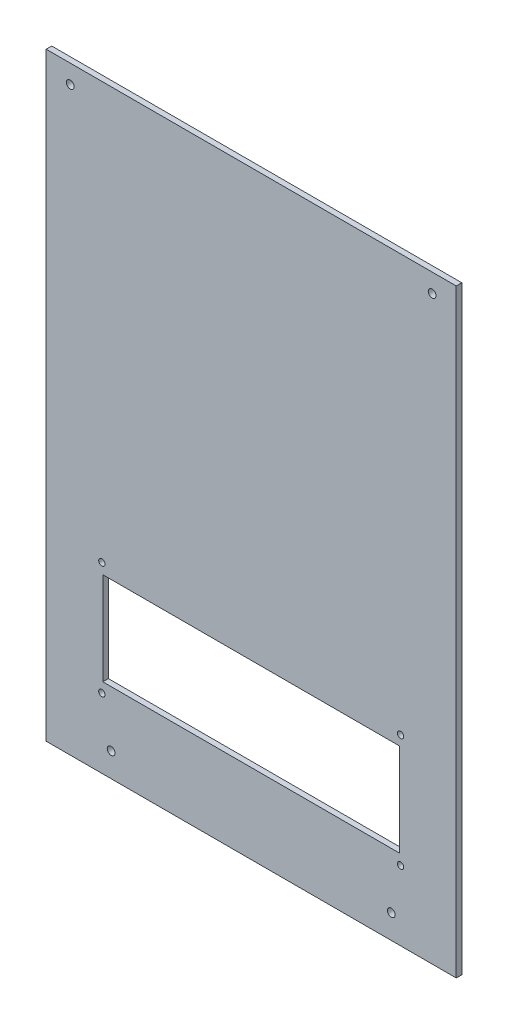
ISO-10303-21;
HEADER;
FILE_DESCRIPTION(('STEP AP214'),'2;1');
FILE_NAME('part.step','',(''),(''),'','','');
FILE_SCHEMA(('AUTOMOTIVE_DESIGN { 1 0 10303 214 1 1 1 1 }'));
ENDSEC;
DATA;
#1=APPLICATION_CONTEXT('core data for automotive mechanical design processes');
#2=APPLICATION_PROTOCOL_DEFINITION('international standard','automotive_design',2000,#1);
#3=PRODUCT_CONTEXT('',#1,'mechanical');
#4=PRODUCT('Part','Part','',(#3));
#5=PRODUCT_RELATED_PRODUCT_CATEGORY('part','',(#4));
#6=PRODUCT_DEFINITION_FORMATION('','',#4);
#7=PRODUCT_DEFINITION_CONTEXT('part definition',#1,'design');
#8=PRODUCT_DEFINITION('design','',#6,#7);
#9=PRODUCT_DEFINITION_SHAPE('','',#8);
#10=(LENGTH_UNIT() NAMED_UNIT(*) SI_UNIT(.MILLI.,.METRE.));
#11=(NAMED_UNIT(*) PLANE_ANGLE_UNIT() SI_UNIT($,.RADIAN.));
#12=(NAMED_UNIT(*) SI_UNIT($,.STERADIAN.) SOLID_ANGLE_UNIT());
#13=UNCERTAINTY_MEASURE_WITH_UNIT(LENGTH_MEASURE(1.E-05),#10,'distance_accuracy_value','');
#14=(GEOMETRIC_REPRESENTATION_CONTEXT(3) GLOBAL_UNCERTAINTY_ASSIGNED_CONTEXT((#13)) GLOBAL_UNIT_ASSIGNED_CONTEXT((#10,
#11,#12)) REPRESENTATION_CONTEXT('',''));
#15=CARTESIAN_POINT('',(0.,0.,0.));
#16=DIRECTION('',(0.,0.,1.));
#17=DIRECTION('',(1.,0.,0.));
#18=AXIS2_PLACEMENT_3D('',#15,#16,#17);
#19=CARTESIAN_POINT('',(0.,0.,-122.5));
#20=DIRECTION('',(0.,0.,-1.));
#21=DIRECTION('',(-1.,0.,0.));
#22=AXIS2_PLACEMENT_3D('',#19,#20,#21);
#23=PLANE('',#22);
#24=CARTESIAN_POINT('',(-75.5,0.,-122.5));
#25=DIRECTION('',(0.,0.,1.));
#26=DIRECTION('',(1.,0.,0.));
#27=AXIS2_PLACEMENT_3D('',#24,#25,#26);
#28=CIRCLE('',#27,2.1);
#29=CARTESIAN_POINT('',(-73.4,0.,-122.5));
#30=VERTEX_POINT('',#29);
#31=EDGE_CURVE('E278',#30,#30,#28,.T.);
#32=ORIENTED_EDGE('',*,*,#31,.F.);
#33=EDGE_LOOP('',(#32));
#34=FACE_BOUND('',#33,.T.);
#35=CARTESIAN_POINT('',(80.5,85.5,-122.5));
#36=DIRECTION('',(0.,0.,-1.));
#37=DIRECTION('',(-1.,0.,0.));
#38=AXIS2_PLACEMENT_3D('',#35,#36,#37);
#39=CIRCLE('',#38,1.70000000000001);
#40=CARTESIAN_POINT('',(78.8,85.5,-122.5));
#41=VERTEX_POINT('',#40);
#42=EDGE_CURVE('E265',#41,#41,#39,.F.);
#43=ORIENTED_EDGE('',*,*,#42,.F.);
#44=EDGE_LOOP('',(#43));
#45=FACE_BOUND('',#44,.T.);
#46=CARTESIAN_POINT('',(80.5,24.5,-122.5));
#47=DIRECTION('',(0.,0.,-1.));
#48=DIRECTION('',(-1.,0.,0.));
#49=AXIS2_PLACEMENT_3D('',#46,#47,#48);
#50=CIRCLE('',#49,1.70000000000001);
#51=CARTESIAN_POINT('',(78.8,24.5,-122.5));
#52=VERTEX_POINT('',#51);
#53=EDGE_CURVE('E271',#52,#52,#50,.F.);
#54=ORIENTED_EDGE('',*,*,#53,.F.);
#55=EDGE_LOOP('',(#54));
#56=FACE_BOUND('',#55,.T.);
#57=CARTESIAN_POINT('',(-80.5,24.5,-122.5));
#58=DIRECTION('',(0.,0.,-1.));
#59=DIRECTION('',(-1.,0.,0.));
#60=AXIS2_PLACEMENT_3D('',#57,#58,#59);
#61=CIRCLE('',#60,1.70000000000001);
#62=CARTESIAN_POINT('',(-82.2,24.5,-122.5));
#63=VERTEX_POINT('',#62);
#64=EDGE_CURVE('E259',#63,#63,#61,.F.);
#65=ORIENTED_EDGE('',*,*,#64,.F.);
#66=EDGE_LOOP('',(#65));
#67=FACE_BOUND('',#66,.T.);
#68=CARTESIAN_POINT('',(-80.5,85.5,-122.5));
#69=DIRECTION('',(0.,0.,-1.));
#70=DIRECTION('',(-1.,0.,0.));
#71=AXIS2_PLACEMENT_3D('',#68,#69,#70);
#72=CIRCLE('',#71,1.7);
#73=CARTESIAN_POINT('',(-82.2,85.5,-122.5));
#74=VERTEX_POINT('',#73);
#75=EDGE_CURVE('E139',#74,#74,#72,.F.);
#76=ORIENTED_EDGE('',*,*,#75,.F.);
#77=EDGE_LOOP('',(#76));
#78=FACE_BOUND('',#77,.T.);
#79=DIRECTION('',(1.,0.,0.));
#80=VECTOR('',#79,1.);
#81=CARTESIAN_POINT('',(-80.,30.,-122.5));
#82=LINE('',#81,#80);
#83=CARTESIAN_POINT('',(-80.,30.,-122.5));
#84=VERTEX_POINT('',#83);
#85=CARTESIAN_POINT('',(80.,30.,-122.5));
#86=VERTEX_POINT('',#85);
#87=EDGE_CURVE('E147',#84,#86,#82,.T.);
#88=ORIENTED_EDGE('',*,*,#87,.F.);
#89=DIRECTION('',(0.,-1.,0.));
#90=VECTOR('',#89,1.);
#91=CARTESIAN_POINT('',(-80.,80.,-122.5));
#92=LINE('',#91,#90);
#93=CARTESIAN_POINT('',(-80.,80.,-122.5));
#94=VERTEX_POINT('',#93);
#95=EDGE_CURVE('E59',#94,#84,#92,.T.);
#96=ORIENTED_EDGE('',*,*,#95,.F.);
#97=DIRECTION('',(-1.,0.,0.));
#98=VECTOR('',#97,1.);
#99=CARTESIAN_POINT('',(-80.,80.,-122.5));
#100=LINE('',#99,#98);
#101=CARTESIAN_POINT('',(80.,80.,-122.5));
#102=VERTEX_POINT('',#101);
#103=EDGE_CURVE('E131',#102,#94,#100,.T.);
#104=ORIENTED_EDGE('',*,*,#103,.F.);
#105=DIRECTION('',(0.,1.,0.));
#106=VECTOR('',#105,1.);
#107=CARTESIAN_POINT('',(80.,80.,-122.5));
#108=LINE('',#107,#106);
#109=EDGE_CURVE('E136',#86,#102,#108,.T.);
#110=ORIENTED_EDGE('',*,*,#109,.F.);
#111=EDGE_LOOP('',(#88,#96,#104,#110));
#112=FACE_BOUND('',#111,.T.);
#113=DIRECTION('',(0.,-1.,0.));
#114=VECTOR('',#113,1.);
#115=CARTESIAN_POINT('',(110.5,310.,-122.5));
#116=LINE('',#115,#114);
#117=CARTESIAN_POINT('',(110.5,310.,-122.5));
#118=VERTEX_POINT('',#117);
#119=CARTESIAN_POINT('',(110.5,-13.,-122.5));
#120=VERTEX_POINT('',#119);
#121=EDGE_CURVE('E160',#118,#120,#116,.T.);
#122=ORIENTED_EDGE('',*,*,#121,.F.);
#123=DIRECTION('',(1.,0.,0.));
#124=VECTOR('',#123,1.);
#125=CARTESIAN_POINT('',(110.5,310.,-122.5));
#126=LINE('',#125,#124);
#127=CARTESIAN_POINT('',(-110.5,310.,-122.5));
#128=VERTEX_POINT('',#127);
#129=EDGE_CURVE('E171',#128,#118,#126,.T.);
#130=ORIENTED_EDGE('',*,*,#129,.F.);
#131=DIRECTION('',(0.,1.,0.));
#132=VECTOR('',#131,1.);
#133=CARTESIAN_POINT('',(-110.5,310.,-122.5));
#134=LINE('',#133,#132);
#135=CARTESIAN_POINT('',(-110.5,-13.,-122.5));
#136=VERTEX_POINT('',#135);
#137=EDGE_CURVE('E167',#136,#128,#134,.T.);
#138=ORIENTED_EDGE('',*,*,#137,.F.);
#139=DIRECTION('',(-1.,0.,0.));
#140=VECTOR('',#139,1.);
#141=CARTESIAN_POINT('',(110.5,-13.,-122.5));
#142=LINE('',#141,#140);
#143=EDGE_CURVE('E163',#120,#136,#142,.T.);
#144=ORIENTED_EDGE('',*,*,#143,.F.);
#145=EDGE_LOOP('',(#122,#130,#138,#144));
#146=FACE_BOUND('',#145,.T.);
#147=CARTESIAN_POINT('',(75.5,0.,-122.5));
#148=DIRECTION('',(0.,0.,1.));
#149=DIRECTION('',(1.,0.,0.));
#150=AXIS2_PLACEMENT_3D('',#147,#148,#149);
#151=CIRCLE('',#150,2.1);
#152=CARTESIAN_POINT('',(77.6,0.,-122.5));
#153=VERTEX_POINT('',#152);
#154=EDGE_CURVE('E282',#153,#153,#151,.T.);
#155=ORIENTED_EDGE('',*,*,#154,.F.);
#156=EDGE_LOOP('',(#155));
#157=FACE_BOUND('',#156,.T.);
#158=CARTESIAN_POINT('',(97.5,300.,-122.5));
#159=DIRECTION('',(0.,0.,1.));
#160=DIRECTION('',(1.,0.,0.));
#161=AXIS2_PLACEMENT_3D('',#158,#159,#160);
#162=CIRCLE('',#161,2.1);
#163=CARTESIAN_POINT('',(99.6,300.,-122.5));
#164=VERTEX_POINT('',#163);
#165=EDGE_CURVE('E286',#164,#164,#162,.T.);
#166=ORIENTED_EDGE('',*,*,#165,.F.);
#167=EDGE_LOOP('',(#166));
#168=FACE_BOUND('',#167,.T.);
#169=CARTESIAN_POINT('',(-97.5,300.,-122.5));
#170=DIRECTION('',(0.,0.,1.));
#171=DIRECTION('',(1.,0.,0.));
#172=AXIS2_PLACEMENT_3D('',#169,#170,#171);
#173=CIRCLE('',#172,2.1);
#174=CARTESIAN_POINT('',(-95.4,300.,-122.5));
#175=VERTEX_POINT('',#174);
#176=EDGE_CURVE('E290',#175,#175,#173,.T.);
#177=ORIENTED_EDGE('',*,*,#176,.F.);
#178=EDGE_LOOP('',(#177));
#179=FACE_BOUND('',#178,.T.);
#180=ADVANCED_FACE('F40',(#34,#45,#56,#67,#78,#112,#146,#157,#168,#179),#23,.F.);
#181=CARTESIAN_POINT('',(110.5,310.,-122.5));
#182=DIRECTION('',(1.,0.,0.));
#183=DIRECTION('',(0.,0.,-1.));
#184=AXIS2_PLACEMENT_3D('',#181,#182,#183);
#185=PLANE('',#184);
#186=DIRECTION('',(0.,-1.,0.));
#187=VECTOR('',#186,1.);
#188=CARTESIAN_POINT('',(110.5,310.,-125.5));
#189=LINE('',#188,#187);
#190=CARTESIAN_POINT('',(110.5,310.,-125.5));
#191=VERTEX_POINT('',#190);
#192=CARTESIAN_POINT('',(110.5,-13.,-125.5));
#193=VERTEX_POINT('',#192);
#194=EDGE_CURVE('E155',#191,#193,#189,.T.);
#195=ORIENTED_EDGE('',*,*,#194,.F.);
#196=DIRECTION('',(0.,0.,-1.));
#197=VECTOR('',#196,1.);
#198=CARTESIAN_POINT('',(110.5,310.,-122.5));
#199=LINE('',#198,#197);
#200=EDGE_CURVE('E11',#118,#191,#199,.T.);
#201=ORIENTED_EDGE('',*,*,#200,.F.);
#202=ORIENTED_EDGE('',*,*,#121,.T.);
#203=DIRECTION('',(0.,0.,-1.));
#204=VECTOR('',#203,1.);
#205=CARTESIAN_POINT('',(110.5,-13.,-122.5));
#206=LINE('',#205,#204);
#207=EDGE_CURVE('E44',#120,#193,#206,.T.);
#208=ORIENTED_EDGE('',*,*,#207,.T.);
#209=EDGE_LOOP('',(#195,#201,#202,#208));
#210=FACE_BOUND('',#209,.T.);
#211=ADVANCED_FACE('F42',(#210),#185,.T.);
#212=CARTESIAN_POINT('',(110.5,310.,-122.5));
#213=DIRECTION('',(0.,1.,0.));
#214=DIRECTION('',(0.,0.,1.));
#215=AXIS2_PLACEMENT_3D('',#212,#213,#214);
#216=PLANE('',#215);
#217=DIRECTION('',(1.,0.,0.));
#218=VECTOR('',#217,1.);
#219=CARTESIAN_POINT('',(110.5,310.,-125.5));
#220=LINE('',#219,#218);
#221=CARTESIAN_POINT('',(-110.5,310.,-125.5));
#222=VERTEX_POINT('',#221);
#223=EDGE_CURVE('E164',#222,#191,#220,.T.);
#224=ORIENTED_EDGE('',*,*,#223,.F.);
#225=DIRECTION('',(0.,0.,-1.));
#226=VECTOR('',#225,1.);
#227=CARTESIAN_POINT('',(-110.5,310.,-122.5));
#228=LINE('',#227,#226);
#229=EDGE_CURVE('E49',#128,#222,#228,.T.);
#230=ORIENTED_EDGE('',*,*,#229,.F.);
#231=ORIENTED_EDGE('',*,*,#129,.T.);
#232=ORIENTED_EDGE('',*,*,#200,.T.);
#233=EDGE_LOOP('',(#224,#230,#231,#232));
#234=FACE_BOUND('',#233,.T.);
#235=ADVANCED_FACE('F196',(#234),#216,.T.);
#236=CARTESIAN_POINT('',(-110.5,310.,-122.5));
#237=DIRECTION('',(-1.,0.,0.));
#238=DIRECTION('',(0.,-1.,0.));
#239=AXIS2_PLACEMENT_3D('',#236,#237,#238);
#240=PLANE('',#239);
#241=DIRECTION('',(0.,1.,0.));
#242=VECTOR('',#241,1.);
#243=CARTESIAN_POINT('',(-110.5,310.,-125.5));
#244=LINE('',#243,#242);
#245=CARTESIAN_POINT('',(-110.5,-13.,-125.5));
#246=VERTEX_POINT('',#245);
#247=EDGE_CURVE('E179',#246,#222,#244,.T.);
#248=ORIENTED_EDGE('',*,*,#247,.F.);
#249=DIRECTION('',(0.,0.,-1.));
#250=VECTOR('',#249,1.);
#251=CARTESIAN_POINT('',(-110.5,-13.,-122.5));
#252=LINE('',#251,#250);
#253=EDGE_CURVE('E185',#136,#246,#252,.T.);
#254=ORIENTED_EDGE('',*,*,#253,.F.);
#255=ORIENTED_EDGE('',*,*,#137,.T.);
#256=ORIENTED_EDGE('',*,*,#229,.T.);
#257=EDGE_LOOP('',(#248,#254,#255,#256));
#258=FACE_BOUND('',#257,.T.);
#259=ADVANCED_FACE('F202',(#258),#240,.T.);
#260=CARTESIAN_POINT('',(110.5,-13.,-122.5));
#261=DIRECTION('',(0.,-1.,0.));
#262=DIRECTION('',(0.,0.,-1.));
#263=AXIS2_PLACEMENT_3D('',#260,#261,#262);
#264=PLANE('',#263);
#265=DIRECTION('',(-1.,0.,0.));
#266=VECTOR('',#265,1.);
#267=CARTESIAN_POINT('',(110.5,-13.,-125.5));
#268=LINE('',#267,#266);
#269=EDGE_CURVE('E176',#193,#246,#268,.T.);
#270=ORIENTED_EDGE('',*,*,#269,.F.);
#271=ORIENTED_EDGE('',*,*,#207,.F.);
#272=ORIENTED_EDGE('',*,*,#143,.T.);
#273=ORIENTED_EDGE('',*,*,#253,.T.);
#274=EDGE_LOOP('',(#270,#271,#272,#273));
#275=FACE_BOUND('',#274,.T.);
#276=ADVANCED_FACE('F193',(#275),#264,.T.);
#277=CARTESIAN_POINT('',(0.,0.,-125.5));
#278=DIRECTION('',(0.,0.,-1.));
#279=DIRECTION('',(-1.,0.,0.));
#280=AXIS2_PLACEMENT_3D('',#277,#278,#279);
#281=PLANE('',#280);
#282=CARTESIAN_POINT('',(-97.5,300.,-125.5));
#283=DIRECTION('',(0.,0.,-1.));
#284=DIRECTION('',(-1.,0.,0.));
#285=AXIS2_PLACEMENT_3D('',#282,#283,#284);
#286=CIRCLE('',#285,2.1);
#287=CARTESIAN_POINT('',(-99.6,300.,-125.5));
#288=VERTEX_POINT('',#287);
#289=EDGE_CURVE('E230',#288,#288,#286,.T.);
#290=ORIENTED_EDGE('',*,*,#289,.F.);
#291=EDGE_LOOP('',(#290));
#292=FACE_BOUND('',#291,.T.);
#293=CARTESIAN_POINT('',(97.5,300.,-125.5));
#294=DIRECTION('',(0.,0.,-1.));
#295=DIRECTION('',(-1.,0.,0.));
#296=AXIS2_PLACEMENT_3D('',#293,#294,#295);
#297=CIRCLE('',#296,2.1);
#298=CARTESIAN_POINT('',(95.4,300.,-125.5));
#299=VERTEX_POINT('',#298);
#300=EDGE_CURVE('E234',#299,#299,#297,.T.);
#301=ORIENTED_EDGE('',*,*,#300,.F.);
#302=EDGE_LOOP('',(#301));
#303=FACE_BOUND('',#302,.T.);
#304=CARTESIAN_POINT('',(75.5,0.,-125.5));
#305=DIRECTION('',(0.,0.,-1.));
#306=DIRECTION('',(-1.,0.,0.));
#307=AXIS2_PLACEMENT_3D('',#304,#305,#306);
#308=CIRCLE('',#307,2.1);
#309=CARTESIAN_POINT('',(73.4,0.,-125.5));
#310=VERTEX_POINT('',#309);
#311=EDGE_CURVE('E238',#310,#310,#308,.T.);
#312=ORIENTED_EDGE('',*,*,#311,.F.);
#313=EDGE_LOOP('',(#312));
#314=FACE_BOUND('',#313,.T.);
#315=CARTESIAN_POINT('',(-75.5,0.,-125.5));
#316=DIRECTION('',(0.,0.,-1.));
#317=DIRECTION('',(-1.,0.,0.));
#318=AXIS2_PLACEMENT_3D('',#315,#316,#317);
#319=CIRCLE('',#318,2.1);
#320=CARTESIAN_POINT('',(-77.6,0.,-125.5));
#321=VERTEX_POINT('',#320);
#322=EDGE_CURVE('E242',#321,#321,#319,.T.);
#323=ORIENTED_EDGE('',*,*,#322,.F.);
#324=EDGE_LOOP('',(#323));
#325=FACE_BOUND('',#324,.T.);
#326=CARTESIAN_POINT('',(80.5,85.5,-125.5));
#327=DIRECTION('',(0.,0.,-1.));
#328=DIRECTION('',(-1.,0.,0.));
#329=AXIS2_PLACEMENT_3D('',#326,#327,#328);
#330=CIRCLE('',#329,1.70000000000001);
#331=CARTESIAN_POINT('',(78.8,85.5,-125.5));
#332=VERTEX_POINT('',#331);
#333=EDGE_CURVE('E246',#332,#332,#330,.T.);
#334=ORIENTED_EDGE('',*,*,#333,.F.);
#335=EDGE_LOOP('',(#334));
#336=FACE_BOUND('',#335,.T.);
#337=CARTESIAN_POINT('',(80.5,24.5,-125.5));
#338=DIRECTION('',(0.,0.,-1.));
#339=DIRECTION('',(-1.,0.,0.));
#340=AXIS2_PLACEMENT_3D('',#337,#338,#339);
#341=CIRCLE('',#340,1.70000000000001);
#342=CARTESIAN_POINT('',(78.8,24.5,-125.5));
#343=VERTEX_POINT('',#342);
#344=EDGE_CURVE('E250',#343,#343,#341,.T.);
#345=ORIENTED_EDGE('',*,*,#344,.F.);
#346=EDGE_LOOP('',(#345));
#347=FACE_BOUND('',#346,.T.);
#348=CARTESIAN_POINT('',(-80.5,24.5,-125.5));
#349=DIRECTION('',(0.,0.,-1.));
#350=DIRECTION('',(-1.,0.,0.));
#351=AXIS2_PLACEMENT_3D('',#348,#349,#350);
#352=CIRCLE('',#351,1.70000000000001);
#353=CARTESIAN_POINT('',(-82.2,24.5,-125.5));
#354=VERTEX_POINT('',#353);
#355=EDGE_CURVE('E254',#354,#354,#352,.T.);
#356=ORIENTED_EDGE('',*,*,#355,.F.);
#357=EDGE_LOOP('',(#356));
#358=FACE_BOUND('',#357,.T.);
#359=CARTESIAN_POINT('',(-80.5,85.5,-125.5));
#360=DIRECTION('',(0.,0.,-1.));
#361=DIRECTION('',(-1.,0.,0.));
#362=AXIS2_PLACEMENT_3D('',#359,#360,#361);
#363=CIRCLE('',#362,1.7);
#364=CARTESIAN_POINT('',(-82.2,85.5,-125.5));
#365=VERTEX_POINT('',#364);
#366=EDGE_CURVE('E257',#365,#365,#363,.T.);
#367=ORIENTED_EDGE('',*,*,#366,.F.);
#368=EDGE_LOOP('',(#367));
#369=FACE_BOUND('',#368,.T.);
#370=DIRECTION('',(0.,-1.,0.));
#371=VECTOR('',#370,1.);
#372=CARTESIAN_POINT('',(-80.,80.,-125.5));
#373=LINE('',#372,#371);
#374=CARTESIAN_POINT('',(-80.,80.,-125.5));
#375=VERTEX_POINT('',#374);
#376=CARTESIAN_POINT('',(-80.,30.,-125.5));
#377=VERTEX_POINT('',#376);
#378=EDGE_CURVE('E112',#375,#377,#373,.T.);
#379=ORIENTED_EDGE('',*,*,#378,.T.);
#380=DIRECTION('',(1.,0.,0.));
#381=VECTOR('',#380,1.);
#382=CARTESIAN_POINT('',(-80.,30.,-125.5));
#383=LINE('',#382,#381);
#384=CARTESIAN_POINT('',(80.,30.,-125.5));
#385=VERTEX_POINT('',#384);
#386=EDGE_CURVE('E122',#377,#385,#383,.T.);
#387=ORIENTED_EDGE('',*,*,#386,.T.);
#388=DIRECTION('',(0.,1.,0.));
#389=VECTOR('',#388,1.);
#390=CARTESIAN_POINT('',(80.,80.,-125.5));
#391=LINE('',#390,#389);
#392=CARTESIAN_POINT('',(80.,80.,-125.5));
#393=VERTEX_POINT('',#392);
#394=EDGE_CURVE('E67',#385,#393,#391,.T.);
#395=ORIENTED_EDGE('',*,*,#394,.T.);
#396=DIRECTION('',(-1.,0.,0.));
#397=VECTOR('',#396,1.);
#398=CARTESIAN_POINT('',(-80.,80.,-125.5));
#399=LINE('',#398,#397);
#400=EDGE_CURVE('E119',#393,#375,#399,.T.);
#401=ORIENTED_EDGE('',*,*,#400,.T.);
#402=EDGE_LOOP('',(#379,#387,#395,#401));
#403=FACE_BOUND('',#402,.T.);
#404=ORIENTED_EDGE('',*,*,#194,.T.);
#405=ORIENTED_EDGE('',*,*,#269,.T.);
#406=ORIENTED_EDGE('',*,*,#247,.T.);
#407=ORIENTED_EDGE('',*,*,#223,.T.);
#408=EDGE_LOOP('',(#404,#405,#406,#407));
#409=FACE_BOUND('',#408,.T.);
#410=ADVANCED_FACE('F127',(#292,#303,#314,#325,#336,#347,#358,#369,#403,#409),#281,.T.);
#411=CARTESIAN_POINT('',(-80.,80.,-125.5));
#412=DIRECTION('',(-1.,0.,0.));
#413=DIRECTION('',(0.,-1.,0.));
#414=AXIS2_PLACEMENT_3D('',#411,#412,#413);
#415=PLANE('',#414);
#416=ORIENTED_EDGE('',*,*,#95,.T.);
#417=DIRECTION('',(0.,0.,1.));
#418=VECTOR('',#417,1.);
#419=CARTESIAN_POINT('',(-80.,30.,-125.5));
#420=LINE('',#419,#418);
#421=EDGE_CURVE('E108',#377,#84,#420,.T.);
#422=ORIENTED_EDGE('',*,*,#421,.F.);
#423=ORIENTED_EDGE('',*,*,#378,.F.);
#424=DIRECTION('',(0.,0.,1.));
#425=VECTOR('',#424,1.);
#426=CARTESIAN_POINT('',(-80.,80.,-125.5));
#427=LINE('',#426,#425);
#428=EDGE_CURVE('E153',#375,#94,#427,.T.);
#429=ORIENTED_EDGE('',*,*,#428,.T.);
#430=EDGE_LOOP('',(#416,#422,#423,#429));
#431=FACE_BOUND('',#430,.T.);
#432=ADVANCED_FACE('F110',(#431),#415,.F.);
#433=CARTESIAN_POINT('',(-80.,80.,-125.5));
#434=DIRECTION('',(0.,1.,0.));
#435=DIRECTION('',(0.,0.,1.));
#436=AXIS2_PLACEMENT_3D('',#433,#434,#435);
#437=PLANE('',#436);
#438=ORIENTED_EDGE('',*,*,#103,.T.);
#439=ORIENTED_EDGE('',*,*,#428,.F.);
#440=ORIENTED_EDGE('',*,*,#400,.F.);
#441=DIRECTION('',(0.,0.,1.));
#442=VECTOR('',#441,1.);
#443=CARTESIAN_POINT('',(80.,80.,-125.5));
#444=LINE('',#443,#442);
#445=EDGE_CURVE('E156',#393,#102,#444,.T.);
#446=ORIENTED_EDGE('',*,*,#445,.T.);
#447=EDGE_LOOP('',(#438,#439,#440,#446));
#448=FACE_BOUND('',#447,.T.);
#449=ADVANCED_FACE('F226',(#448),#437,.F.);
#450=CARTESIAN_POINT('',(80.,80.,-125.5));
#451=DIRECTION('',(1.,0.,0.));
#452=DIRECTION('',(0.,1.,0.));
#453=AXIS2_PLACEMENT_3D('',#450,#451,#452);
#454=PLANE('',#453);
#455=ORIENTED_EDGE('',*,*,#109,.T.);
#456=ORIENTED_EDGE('',*,*,#445,.F.);
#457=ORIENTED_EDGE('',*,*,#394,.F.);
#458=DIRECTION('',(0.,0.,1.));
#459=VECTOR('',#458,1.);
#460=CARTESIAN_POINT('',(80.,30.,-125.5));
#461=LINE('',#460,#459);
#462=EDGE_CURVE('E118',#385,#86,#461,.T.);
#463=ORIENTED_EDGE('',*,*,#462,.T.);
#464=EDGE_LOOP('',(#455,#456,#457,#463));
#465=FACE_BOUND('',#464,.T.);
#466=ADVANCED_FACE('F331',(#465),#454,.F.);
#467=CARTESIAN_POINT('',(-80.,30.,-125.5));
#468=DIRECTION('',(0.,-1.,0.));
#469=DIRECTION('',(0.,0.,-1.));
#470=AXIS2_PLACEMENT_3D('',#467,#468,#469);
#471=PLANE('',#470);
#472=ORIENTED_EDGE('',*,*,#87,.T.);
#473=ORIENTED_EDGE('',*,*,#462,.F.);
#474=ORIENTED_EDGE('',*,*,#386,.F.);
#475=ORIENTED_EDGE('',*,*,#421,.T.);
#476=EDGE_LOOP('',(#472,#473,#474,#475));
#477=FACE_BOUND('',#476,.T.);
#478=ADVANCED_FACE('F123',(#477),#471,.F.);
#479=CARTESIAN_POINT('',(-80.5,85.5,-122.499));
#480=DIRECTION('',(0.,0.,-1.));
#481=DIRECTION('',(-1.,0.,0.));
#482=AXIS2_PLACEMENT_3D('',#479,#480,#481);
#483=CYLINDRICAL_SURFACE('',#482,1.7);
#484=ORIENTED_EDGE('',*,*,#366,.T.);
#485=EDGE_LOOP('',(#484));
#486=FACE_BOUND('',#485,.T.);
#487=ORIENTED_EDGE('',*,*,#75,.T.);
#488=EDGE_LOOP('',(#487));
#489=FACE_BOUND('',#488,.T.);
#490=ADVANCED_FACE('F319',(#486,#489),#483,.F.);
#491=CARTESIAN_POINT('',(-80.5,24.5,-122.499));
#492=DIRECTION('',(0.,0.,-1.));
#493=DIRECTION('',(-1.,0.,0.));
#494=AXIS2_PLACEMENT_3D('',#491,#492,#493);
#495=CYLINDRICAL_SURFACE('',#494,1.70000000000001);
#496=ORIENTED_EDGE('',*,*,#355,.T.);
#497=EDGE_LOOP('',(#496));
#498=FACE_BOUND('',#497,.T.);
#499=ORIENTED_EDGE('',*,*,#64,.T.);
#500=EDGE_LOOP('',(#499));
#501=FACE_BOUND('',#500,.T.);
#502=ADVANCED_FACE('F315',(#498,#501),#495,.F.);
#503=CARTESIAN_POINT('',(80.5,24.5,-122.499));
#504=DIRECTION('',(0.,0.,-1.));
#505=DIRECTION('',(-1.,0.,0.));
#506=AXIS2_PLACEMENT_3D('',#503,#504,#505);
#507=CYLINDRICAL_SURFACE('',#506,1.70000000000001);
#508=ORIENTED_EDGE('',*,*,#344,.T.);
#509=EDGE_LOOP('',(#508));
#510=FACE_BOUND('',#509,.T.);
#511=ORIENTED_EDGE('',*,*,#53,.T.);
#512=EDGE_LOOP('',(#511));
#513=FACE_BOUND('',#512,.T.);
#514=ADVANCED_FACE('F318',(#510,#513),#507,.F.);
#515=CARTESIAN_POINT('',(80.5,85.5,-122.499));
#516=DIRECTION('',(0.,0.,-1.));
#517=DIRECTION('',(-1.,0.,0.));
#518=AXIS2_PLACEMENT_3D('',#515,#516,#517);
#519=CYLINDRICAL_SURFACE('',#518,1.70000000000001);
#520=ORIENTED_EDGE('',*,*,#333,.T.);
#521=EDGE_LOOP('',(#520));
#522=FACE_BOUND('',#521,.T.);
#523=ORIENTED_EDGE('',*,*,#42,.T.);
#524=EDGE_LOOP('',(#523));
#525=FACE_BOUND('',#524,.T.);
#526=ADVANCED_FACE('F313',(#522,#525),#519,.F.);
#527=CARTESIAN_POINT('',(-75.5,0.,-122.5));
#528=DIRECTION('',(0.,0.,1.));
#529=DIRECTION('',(1.,0.,0.));
#530=AXIS2_PLACEMENT_3D('',#527,#528,#529);
#531=CYLINDRICAL_SURFACE('',#530,2.1);
#532=ORIENTED_EDGE('',*,*,#31,.T.);
#533=EDGE_LOOP('',(#532));
#534=FACE_BOUND('',#533,.T.);
#535=ORIENTED_EDGE('',*,*,#322,.T.);
#536=EDGE_LOOP('',(#535));
#537=FACE_BOUND('',#536,.T.);
#538=ADVANCED_FACE('F309',(#534,#537),#531,.F.);
#539=CARTESIAN_POINT('',(75.5,0.,-122.5));
#540=DIRECTION('',(0.,0.,1.));
#541=DIRECTION('',(1.,0.,0.));
#542=AXIS2_PLACEMENT_3D('',#539,#540,#541);
#543=CYLINDRICAL_SURFACE('',#542,2.1);
#544=ORIENTED_EDGE('',*,*,#154,.T.);
#545=EDGE_LOOP('',(#544));
#546=FACE_BOUND('',#545,.T.);
#547=ORIENTED_EDGE('',*,*,#311,.T.);
#548=EDGE_LOOP('',(#547));
#549=FACE_BOUND('',#548,.T.);
#550=ADVANCED_FACE('F303',(#546,#549),#543,.F.);
#551=CARTESIAN_POINT('',(97.5,300.,-122.5));
#552=DIRECTION('',(0.,0.,1.));
#553=DIRECTION('',(1.,0.,0.));
#554=AXIS2_PLACEMENT_3D('',#551,#552,#553);
#555=CYLINDRICAL_SURFACE('',#554,2.1);
#556=ORIENTED_EDGE('',*,*,#165,.T.);
#557=EDGE_LOOP('',(#556));
#558=FACE_BOUND('',#557,.T.);
#559=ORIENTED_EDGE('',*,*,#300,.T.);
#560=EDGE_LOOP('',(#559));
#561=FACE_BOUND('',#560,.T.);
#562=ADVANCED_FACE('F298',(#558,#561),#555,.F.);
#563=CARTESIAN_POINT('',(-97.5,300.,-122.5));
#564=DIRECTION('',(0.,0.,1.));
#565=DIRECTION('',(1.,0.,0.));
#566=AXIS2_PLACEMENT_3D('',#563,#564,#565);
#567=CYLINDRICAL_SURFACE('',#566,2.1);
#568=ORIENTED_EDGE('',*,*,#176,.T.);
#569=EDGE_LOOP('',(#568));
#570=FACE_BOUND('',#569,.T.);
#571=ORIENTED_EDGE('',*,*,#289,.T.);
#572=EDGE_LOOP('',(#571));
#573=FACE_BOUND('',#572,.T.);
#574=ADVANCED_FACE('F294',(#570,#573),#567,.F.);
#575=CLOSED_SHELL('',(#180,#211,#235,#259,#276,#410,#432,#449,#466,#478,#490,#502,#514,#526,
#538,#550,#562,#574));
#576=MANIFOLD_SOLID_BREP('B2',#575);
#577=ADVANCED_BREP_SHAPE_REPRESENTATION('',(#18,#576),#14);
#578=SHAPE_DEFINITION_REPRESENTATION(#9,#577);
ENDSEC;
END-ISO-10303-21;
